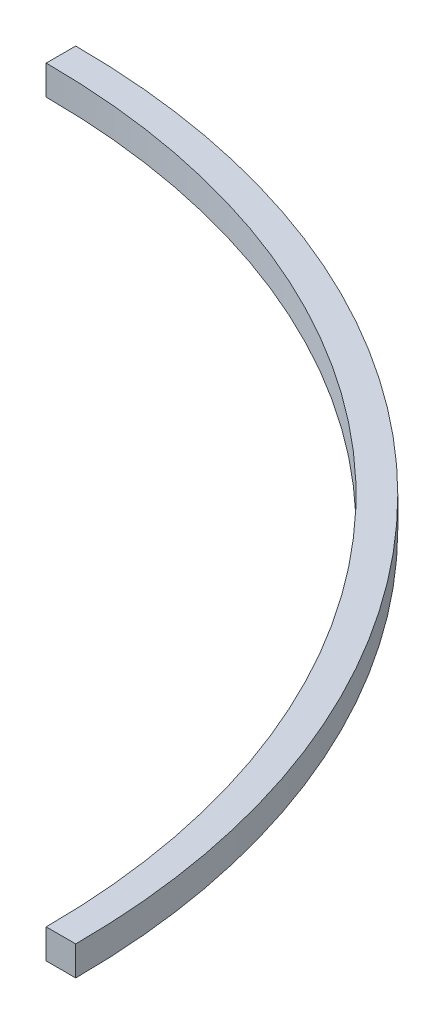
ISO-10303-21;
HEADER;
FILE_DESCRIPTION(('STEP AP214'),'2;1');
FILE_NAME('part.step','',(''),(''),'','','');
FILE_SCHEMA(('AUTOMOTIVE_DESIGN { 1 0 10303 214 1 1 1 1 }'));
ENDSEC;
DATA;
#1=APPLICATION_CONTEXT('core data for automotive mechanical design processes');
#2=APPLICATION_PROTOCOL_DEFINITION('international standard','automotive_design',2000,#1);
#3=PRODUCT_CONTEXT('',#1,'mechanical');
#4=PRODUCT('Part','Part','',(#3));
#5=PRODUCT_RELATED_PRODUCT_CATEGORY('part','',(#4));
#6=PRODUCT_DEFINITION_FORMATION('','',#4);
#7=PRODUCT_DEFINITION_CONTEXT('part definition',#1,'design');
#8=PRODUCT_DEFINITION('design','',#6,#7);
#9=PRODUCT_DEFINITION_SHAPE('','',#8);
#10=(LENGTH_UNIT() NAMED_UNIT(*) SI_UNIT(.MILLI.,.METRE.));
#11=(NAMED_UNIT(*) PLANE_ANGLE_UNIT() SI_UNIT($,.RADIAN.));
#12=(NAMED_UNIT(*) SI_UNIT($,.STERADIAN.) SOLID_ANGLE_UNIT());
#13=UNCERTAINTY_MEASURE_WITH_UNIT(LENGTH_MEASURE(1.E-05),#10,'distance_accuracy_value','');
#14=(GEOMETRIC_REPRESENTATION_CONTEXT(3) GLOBAL_UNCERTAINTY_ASSIGNED_CONTEXT((#13)) GLOBAL_UNIT_ASSIGNED_CONTEXT((#10,
#11,#12)) REPRESENTATION_CONTEXT('',''));
#15=CARTESIAN_POINT('',(0.,0.,0.));
#16=DIRECTION('',(0.,0.,1.));
#17=DIRECTION('',(1.,0.,0.));
#18=AXIS2_PLACEMENT_3D('',#15,#16,#17);
#19=CARTESIAN_POINT('',(0.,3.,0.));
#20=DIRECTION('',(0.,-1.,0.));
#21=DIRECTION('',(0.,0.,-1.));
#22=AXIS2_PLACEMENT_3D('',#19,#20,#21);
#23=CYLINDRICAL_SURFACE('',#22,76.);
#24=CARTESIAN_POINT('',(0.,0.,0.));
#25=DIRECTION('',(0.,-1.,0.));
#26=DIRECTION('',(0.,0.,-1.));
#27=AXIS2_PLACEMENT_3D('',#24,#25,#26);
#28=CIRCLE('',#27,76.);
#29=CARTESIAN_POINT('',(0.,0.,-76.));
#30=VERTEX_POINT('',#29);
#31=CARTESIAN_POINT('',(76.,0.,0.));
#32=VERTEX_POINT('',#31);
#33=EDGE_CURVE('E96',#30,#32,#28,.T.);
#34=ORIENTED_EDGE('',*,*,#33,.T.);
#35=DIRECTION('',(0.,-1.,0.));
#36=VECTOR('',#35,1.);
#37=CARTESIAN_POINT('',(76.,3.,0.));
#38=LINE('',#37,#36);
#39=CARTESIAN_POINT('',(76.,3.,0.));
#40=VERTEX_POINT('',#39);
#41=EDGE_CURVE('E11',#40,#32,#38,.T.);
#42=ORIENTED_EDGE('',*,*,#41,.F.);
#43=CARTESIAN_POINT('',(0.,3.,0.));
#44=DIRECTION('',(0.,-1.,0.));
#45=DIRECTION('',(0.,0.,-1.));
#46=AXIS2_PLACEMENT_3D('',#43,#44,#45);
#47=CIRCLE('',#46,76.);
#48=CARTESIAN_POINT('',(0.,3.,-76.));
#49=VERTEX_POINT('',#48);
#50=EDGE_CURVE('E84',#49,#40,#47,.T.);
#51=ORIENTED_EDGE('',*,*,#50,.F.);
#52=DIRECTION('',(0.,-1.,0.));
#53=VECTOR('',#52,1.);
#54=CARTESIAN_POINT('',(0.,3.,-76.));
#55=LINE('',#54,#53);
#56=EDGE_CURVE('E92',#49,#30,#55,.T.);
#57=ORIENTED_EDGE('',*,*,#56,.T.);
#58=EDGE_LOOP('',(#34,#42,#51,#57));
#59=FACE_BOUND('',#58,.T.);
#60=ADVANCED_FACE('F33',(#59),#23,.F.);
#61=CARTESIAN_POINT('',(76.,3.,0.));
#62=DIRECTION('',(0.,0.,-1.));
#63=DIRECTION('',(-1.,0.,0.));
#64=AXIS2_PLACEMENT_3D('',#61,#62,#63);
#65=PLANE('',#64);
#66=DIRECTION('',(1.,0.,0.));
#67=VECTOR('',#66,1.);
#68=CARTESIAN_POINT('',(76.,0.,0.));
#69=LINE('',#68,#67);
#70=CARTESIAN_POINT('',(79.,0.,0.));
#71=VERTEX_POINT('',#70);
#72=EDGE_CURVE('E88',#32,#71,#69,.T.);
#73=ORIENTED_EDGE('',*,*,#72,.T.);
#74=DIRECTION('',(0.,-1.,0.));
#75=VECTOR('',#74,1.);
#76=CARTESIAN_POINT('',(79.,3.,0.));
#77=LINE('',#76,#75);
#78=CARTESIAN_POINT('',(79.,3.,0.));
#79=VERTEX_POINT('',#78);
#80=EDGE_CURVE('E41',#79,#71,#77,.T.);
#81=ORIENTED_EDGE('',*,*,#80,.F.);
#82=DIRECTION('',(1.,0.,0.));
#83=VECTOR('',#82,1.);
#84=CARTESIAN_POINT('',(76.,3.,0.));
#85=LINE('',#84,#83);
#86=EDGE_CURVE('E79',#40,#79,#85,.T.);
#87=ORIENTED_EDGE('',*,*,#86,.F.);
#88=ORIENTED_EDGE('',*,*,#41,.T.);
#89=EDGE_LOOP('',(#73,#81,#87,#88));
#90=FACE_BOUND('',#89,.T.);
#91=ADVANCED_FACE('F87',(#90),#65,.F.);
#92=CARTESIAN_POINT('',(0.,3.,0.));
#93=DIRECTION('',(0.,-1.,0.));
#94=DIRECTION('',(0.,0.,-1.));
#95=AXIS2_PLACEMENT_3D('',#92,#93,#94);
#96=CYLINDRICAL_SURFACE('',#95,79.);
#97=CARTESIAN_POINT('',(0.,0.,0.));
#98=DIRECTION('',(0.,1.,0.));
#99=DIRECTION('',(0.,0.,-1.));
#100=AXIS2_PLACEMENT_3D('',#97,#98,#99);
#101=CIRCLE('',#100,79.);
#102=CARTESIAN_POINT('',(0.,0.,-79.));
#103=VERTEX_POINT('',#102);
#104=EDGE_CURVE('E66',#71,#103,#101,.T.);
#105=ORIENTED_EDGE('',*,*,#104,.T.);
#106=DIRECTION('',(0.,-1.,0.));
#107=VECTOR('',#106,1.);
#108=CARTESIAN_POINT('',(0.,3.,-79.));
#109=LINE('',#108,#107);
#110=CARTESIAN_POINT('',(0.,3.,-79.));
#111=VERTEX_POINT('',#110);
#112=EDGE_CURVE('E89',#111,#103,#109,.T.);
#113=ORIENTED_EDGE('',*,*,#112,.F.);
#114=CARTESIAN_POINT('',(0.,3.,0.));
#115=DIRECTION('',(0.,1.,0.));
#116=DIRECTION('',(0.,0.,-1.));
#117=AXIS2_PLACEMENT_3D('',#114,#115,#116);
#118=CIRCLE('',#117,79.);
#119=EDGE_CURVE('E82',#79,#111,#118,.T.);
#120=ORIENTED_EDGE('',*,*,#119,.F.);
#121=ORIENTED_EDGE('',*,*,#80,.T.);
#122=EDGE_LOOP('',(#105,#113,#120,#121));
#123=FACE_BOUND('',#122,.T.);
#124=ADVANCED_FACE('F90',(#123),#96,.T.);
#125=CARTESIAN_POINT('',(0.,3.,-79.));
#126=DIRECTION('',(1.,0.,0.));
#127=DIRECTION('',(0.,0.,-1.));
#128=AXIS2_PLACEMENT_3D('',#125,#126,#127);
#129=PLANE('',#128);
#130=DIRECTION('',(0.,0.,1.));
#131=VECTOR('',#130,1.);
#132=CARTESIAN_POINT('',(0.,0.,-79.));
#133=LINE('',#132,#131);
#134=EDGE_CURVE('E72',#103,#30,#133,.T.);
#135=ORIENTED_EDGE('',*,*,#134,.T.);
#136=ORIENTED_EDGE('',*,*,#56,.F.);
#137=DIRECTION('',(0.,0.,1.));
#138=VECTOR('',#137,1.);
#139=CARTESIAN_POINT('',(0.,3.,-79.));
#140=LINE('',#139,#138);
#141=EDGE_CURVE('E49',#111,#49,#140,.T.);
#142=ORIENTED_EDGE('',*,*,#141,.F.);
#143=ORIENTED_EDGE('',*,*,#112,.T.);
#144=EDGE_LOOP('',(#135,#136,#142,#143));
#145=FACE_BOUND('',#144,.T.);
#146=ADVANCED_FACE('F103',(#145),#129,.F.);
#147=CARTESIAN_POINT('',(0.,3.,0.));
#148=DIRECTION('',(0.,-1.,0.));
#149=DIRECTION('',(0.,0.,-1.));
#150=AXIS2_PLACEMENT_3D('',#147,#148,#149);
#151=PLANE('',#150);
#152=ORIENTED_EDGE('',*,*,#50,.T.);
#153=ORIENTED_EDGE('',*,*,#86,.T.);
#154=ORIENTED_EDGE('',*,*,#119,.T.);
#155=ORIENTED_EDGE('',*,*,#141,.T.);
#156=EDGE_LOOP('',(#152,#153,#154,#155));
#157=FACE_BOUND('',#156,.T.);
#158=ADVANCED_FACE('F80',(#157),#151,.F.);
#159=CARTESIAN_POINT('',(0.,0.,0.));
#160=DIRECTION('',(0.,-1.,0.));
#161=DIRECTION('',(0.,0.,-1.));
#162=AXIS2_PLACEMENT_3D('',#159,#160,#161);
#163=PLANE('',#162);
#164=ORIENTED_EDGE('',*,*,#33,.F.);
#165=ORIENTED_EDGE('',*,*,#134,.F.);
#166=ORIENTED_EDGE('',*,*,#104,.F.);
#167=ORIENTED_EDGE('',*,*,#72,.F.);
#168=EDGE_LOOP('',(#164,#165,#166,#167));
#169=FACE_BOUND('',#168,.T.);
#170=ADVANCED_FACE('F106',(#169),#163,.T.);
#171=CLOSED_SHELL('',(#60,#91,#124,#146,#158,#170));
#172=MANIFOLD_SOLID_BREP('B2',#171);
#173=ADVANCED_BREP_SHAPE_REPRESENTATION('',(#18,#172),#14);
#174=SHAPE_DEFINITION_REPRESENTATION(#9,#173);
ENDSEC;
END-ISO-10303-21;
